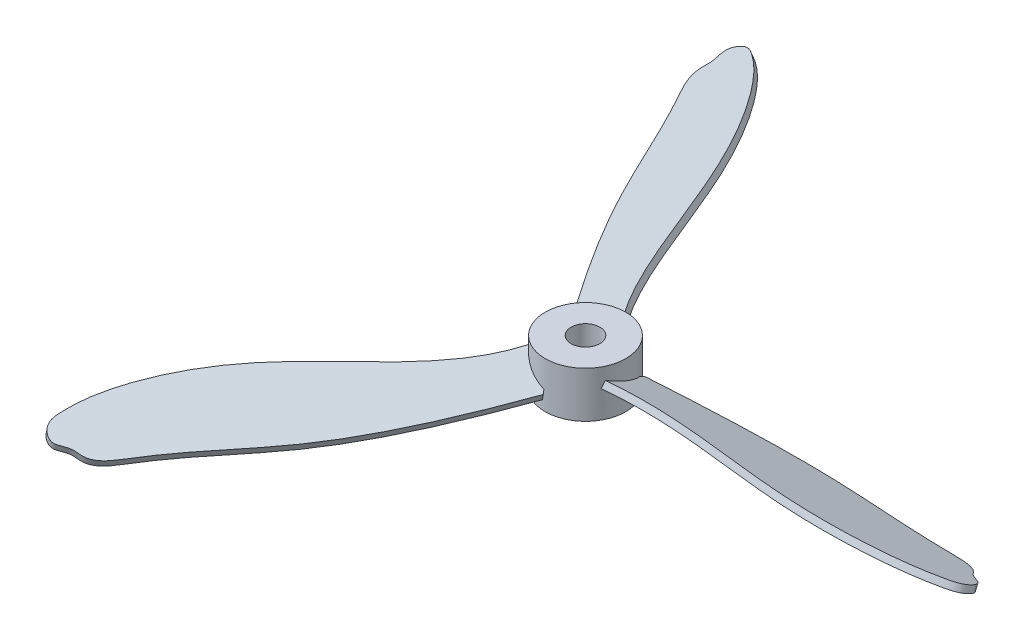
ISO-10303-21;
HEADER;
FILE_DESCRIPTION(('STEP AP214'),'2;1');
FILE_NAME('part.step','',(''),(''),'','','');
FILE_SCHEMA(('AUTOMOTIVE_DESIGN { 1 0 10303 214 1 1 1 1 }'));
ENDSEC;
DATA;
#1=APPLICATION_CONTEXT('core data for automotive mechanical design processes');
#2=APPLICATION_PROTOCOL_DEFINITION('international standard','automotive_design',2000,#1);
#3=PRODUCT_CONTEXT('',#1,'mechanical');
#4=PRODUCT('Part','Part','',(#3));
#5=PRODUCT_RELATED_PRODUCT_CATEGORY('part','',(#4));
#6=PRODUCT_DEFINITION_FORMATION('','',#4);
#7=PRODUCT_DEFINITION_CONTEXT('part definition',#1,'design');
#8=PRODUCT_DEFINITION('design','',#6,#7);
#9=PRODUCT_DEFINITION_SHAPE('','',#8);
#10=(LENGTH_UNIT() NAMED_UNIT(*) SI_UNIT(.MILLI.,.METRE.));
#11=(NAMED_UNIT(*) PLANE_ANGLE_UNIT() SI_UNIT($,.RADIAN.));
#12=(NAMED_UNIT(*) SI_UNIT($,.STERADIAN.) SOLID_ANGLE_UNIT());
#13=UNCERTAINTY_MEASURE_WITH_UNIT(LENGTH_MEASURE(1.E-05),#10,'distance_accuracy_value','');
#14=(GEOMETRIC_REPRESENTATION_CONTEXT(3) GLOBAL_UNCERTAINTY_ASSIGNED_CONTEXT((#13)) GLOBAL_UNIT_ASSIGNED_CONTEXT((#10,
#11,#12)) REPRESENTATION_CONTEXT('',''));
#15=CARTESIAN_POINT('',(0.,0.,0.));
#16=DIRECTION('',(0.,0.,1.));
#17=DIRECTION('',(1.,0.,0.));
#18=AXIS2_PLACEMENT_3D('',#15,#16,#17);
#19=CARTESIAN_POINT('',(0.,-4.,0.));
#20=DIRECTION('',(0.,1.,0.));
#21=DIRECTION('',(0.,0.,1.));
#22=AXIS2_PLACEMENT_3D('',#19,#20,#21);
#23=CYLINDRICAL_SURFACE('',#22,7.);
#24=CARTESIAN_POINT('',(0.,0.649435320175439,0.));
#25=DIRECTION('',(0.331413574035593,0.923879532511287,0.191341716182542));
#26=DIRECTION('',(-0.80010314519127,0.38268343236509,-0.461939766255636));
#27=AXIS2_PLACEMENT_3D('',#24,#25,#26);
#28=ELLIPSE('',#27,7.57674540204676,7.);
#29=CARTESIAN_POINT('',(-0.233981537066314,-0.715568292985856,6.99608838139657));
#30=VERTEX_POINT('',#29);
#31=CARTESIAN_POINT('',(-5.69895796905672,1.85193321203644,4.06471131409415));
#32=VERTEX_POINT('',#31);
#33=EDGE_CURVE('E11',#30,#32,#28,.F.);
#34=ORIENTED_EDGE('',*,*,#33,.F.);
#35=CARTESIAN_POINT('',(0.,36.1517341565032,0.));
#36=DIRECTION('',(0.741474590271592,-0.129634901341056,-0.65833898892278));
#37=DIRECTION('',(0.0969389763581632,0.991561794521297,-0.0860699861062893));
#38=AXIS2_PLACEMENT_3D('',#35,#36,#37);
#39=ELLIPSE('',#38,53.997804044944,7.);
#40=CARTESIAN_POINT('',(-0.456472154964879,-1.93235161450674,6.98510079896788));
#41=VERTEX_POINT('',#40);
#42=EDGE_CURVE('E164',#41,#30,#39,.F.);
#43=ORIENTED_EDGE('',*,*,#42,.F.);
#44=CARTESIAN_POINT('',(0.,-0.649435320175434,0.));
#45=DIRECTION('',(0.331413574035593,0.923879532511287,0.191341716182542));
#46=DIRECTION('',(-0.80010314519127,0.38268343236509,-0.461939766255636));
#47=AXIS2_PLACEMENT_3D('',#44,#45,#46);
#48=ELLIPSE('',#47,7.57674540204676,7.);
#49=CARTESIAN_POINT('',(-6.00799740329603,0.761779417307958,3.59220923694433));
#50=VERTEX_POINT('',#49);
#51=EDGE_CURVE('E116',#41,#50,#48,.F.);
#52=ORIENTED_EDGE('',*,*,#51,.T.);
#53=CARTESIAN_POINT('',(-5.69895796905672,1.85193321203644,4.06471131409414));
#54=CARTESIAN_POINT('',(-5.71670376358482,1.79094450689966,4.03983049687951));
#55=CARTESIAN_POINT('',(-5.73435871566813,1.73001773568598,4.01473277115989));
#56=CARTESIAN_POINT('',(-5.76948000274245,1.60830276861221,3.96409513453521));
#57=CARTESIAN_POINT('',(-5.78694635973355,1.54751455725591,3.93855527613098));
#58=CARTESIAN_POINT('',(-5.82168662404844,1.42608083280721,3.88702075719369));
#59=CARTESIAN_POINT('',(-5.83896054336394,1.36543531101102,3.86102612526214));
#60=CARTESIAN_POINT('',(-5.87331184698468,1.24429112556073,3.80856809179306));
#61=CARTESIAN_POINT('',(-5.89038923035562,1.18379246260586,3.78210468802858));
#62=CARTESIAN_POINT('',(-5.92434277203603,1.06294760964318,3.728694718011));
#63=CARTESIAN_POINT('',(-5.94121891863318,1.00260142866962,3.70174812386173));
#64=CARTESIAN_POINT('',(-5.97476494660159,0.882067361104412,3.64735580338877));
#65=CARTESIAN_POINT('',(-5.99143480215664,0.821879495052533,3.61991001563424));
#66=CARTESIAN_POINT('',(-6.00799740329603,0.761779417307958,3.59220923694433));
#67=B_SPLINE_CURVE_WITH_KNOTS('',3,(#53,#54,#55,#56,#57,#58,#59,#60,#61,#62,#63,#64,#65,#66),
.UNSPECIFIED.,.F.,.F.,(4,2,2,2,2,2,4),(0.,0.204651417883314,0.409278698994972,0.613893156677688,
0.818508586662214,1.02313586804236,1.2277885035829),.UNSPECIFIED.);
#68=EDGE_CURVE('E52',#32,#50,#67,.T.);
#69=ORIENTED_EDGE('',*,*,#68,.F.);
#70=EDGE_LOOP('',(#34,#43,#52,#69));
#71=FACE_BOUND('',#70,.T.);
#72=CARTESIAN_POINT('',(0.,0.649435320175437,0.));
#73=DIRECTION('',(-0.331413574035591,0.923879532511287,0.191341716182546));
#74=DIRECTION('',(0.800103145191263,0.38268343236509,-0.461939766255647));
#75=AXIS2_PLACEMENT_3D('',#72,#73,#74);
#76=ELLIPSE('',#75,7.57674540204676,7.);
#77=CARTESIAN_POINT('',(-5.94179949687741,-0.715568292985855,-3.70067814581427));
#78=VERTEX_POINT('',#77);
#79=CARTESIAN_POINT('',(-0.670664272527165,1.85193321203644,-6.96779803334997));
#80=VERTEX_POINT('',#79);
#81=EDGE_CURVE('E169',#78,#80,#76,.F.);
#82=ORIENTED_EDGE('',*,*,#81,.F.);
#83=CARTESIAN_POINT('',(0.,36.1517341565032,0.));
#84=DIRECTION('',(0.199400993573089,-0.129634901341056,0.971305325897248));
#85=DIRECTION('',(0.026069306292338,0.991561794521297,0.126986609196173));
#86=AXIS2_PLACEMENT_3D('',#83,#84,#85);
#87=ELLIPSE('',#86,53.9978040449441,7.);
#88=CARTESIAN_POINT('',(-5.8210386624187,-1.93235161450674,-3.88786688180378));
#89=VERTEX_POINT('',#88);
#90=EDGE_CURVE('E180',#89,#78,#87,.F.);
#91=ORIENTED_EDGE('',*,*,#90,.F.);
#92=CARTESIAN_POINT('',(0.,-0.649435320175434,0.));
#93=DIRECTION('',(-0.331413574035591,0.923879532511287,0.191341716182546));
#94=DIRECTION('',(0.800103145191263,0.38268343236509,-0.461939766255647));
#95=AXIS2_PLACEMENT_3D('',#92,#93,#94);
#96=ELLIPSE('',#95,7.57674540204676,7.);
#97=CARTESIAN_POINT('',(-0.106945753254865,0.761779417307957,-6.99918299559748));
#98=VERTEX_POINT('',#97);
#99=EDGE_CURVE('E259',#89,#98,#96,.F.);
#100=ORIENTED_EDGE('',*,*,#99,.T.);
#101=CARTESIAN_POINT('',(-0.670664272527156,1.85193321203644,-6.96779803334996));
#102=CARTESIAN_POINT('',(-0.640243955488321,1.79094450689966,-6.97072593361432));
#103=CARTESIAN_POINT('',(-0.60968121139626,1.73001773568598,-6.97346670776126));
#104=CARTESIAN_POINT('',(-0.548267088154522,1.60830276861221,-6.97856381626888));
#105=CARTESIAN_POINT('',(-0.517415743471851,1.54751455725591,-6.98092019593262));
#106=CARTESIAN_POINT('',(-0.455415408742906,1.42608083280721,-6.98523888789486));
#107=CARTESIAN_POINT('',(-0.424266437470407,1.36543531101102,-6.98720122487923));
#108=CARTESIAN_POINT('',(-0.361660796043238,1.24429112556073,-6.99072130973336));
#109=CARTESIAN_POINT('',(-0.330204124427126,1.18379246260586,-6.99227905568053));
#110=CARTESIAN_POINT('',(-0.266972962736327,1.06294760964318,-6.99497870031543));
#111=CARTESIAN_POINT('',(-0.235198454359017,1.00260142866962,-6.99612057491192));
#112=CARTESIAN_POINT('',(-0.171320309074448,0.882067361104412,-6.99797612709213));
#113=CARTESIAN_POINT('',(-0.139216631874623,0.821879495052533,-6.99868975160296));
#114=CARTESIAN_POINT('',(-0.106945753254856,0.761779417307958,-6.99918299559747));
#115=B_SPLINE_CURVE_WITH_KNOTS('',3,(#101,#102,#103,#104,#105,#106,#107,#108,#109,#110,#111,
#112,#113,#114),.UNSPECIFIED.,.F.,.F.,(4,2,2,2,2,2,4),(0.,0.204651417883314,0.409278698994971,
0.613893156677686,0.818508586662211,1.02313586804236,1.2277885035829),.UNSPECIFIED.);
#116=EDGE_CURVE('E172',#80,#98,#115,.T.);
#117=ORIENTED_EDGE('',*,*,#116,.F.);
#118=EDGE_LOOP('',(#82,#91,#100,#117));
#119=FACE_BOUND('',#118,.T.);
#120=CARTESIAN_POINT('',(0.,0.649435320175438,0.));
#121=DIRECTION('',(0.,0.923879532511287,-0.38268343236509));
#122=DIRECTION('',(0.,0.38268343236509,0.923879532511287));
#123=AXIS2_PLACEMENT_3D('',#120,#121,#122);
#124=ELLIPSE('',#123,7.57674540204676,7.);
#125=CARTESIAN_POINT('',(6.17578103394377,-0.715568292985857,-3.29541023558227));
#126=VERTEX_POINT('',#125);
#127=CARTESIAN_POINT('',(6.36962224158388,1.85193321203644,2.90308671925588));
#128=VERTEX_POINT('',#127);
#129=EDGE_CURVE('E255',#126,#128,#124,.F.);
#130=ORIENTED_EDGE('',*,*,#129,.F.);
#131=CARTESIAN_POINT('',(0.,36.1517341565032,0.));
#132=DIRECTION('',(-0.940875583844683,-0.129634901341056,-0.312966336974476));
#133=DIRECTION('',(-0.123008282650501,0.991561794521297,-0.040916623089885));
#134=AXIS2_PLACEMENT_3D('',#131,#132,#133);
#135=ELLIPSE('',#134,53.9978040449441,7.);
#136=CARTESIAN_POINT('',(6.27751081738363,-1.93235161450674,-3.09723391716407));
#137=VERTEX_POINT('',#136);
#138=EDGE_CURVE('E256',#137,#126,#135,.F.);
#139=ORIENTED_EDGE('',*,*,#138,.F.);
#140=CARTESIAN_POINT('',(0.,-0.649435320175435,0.));
#141=DIRECTION('',(0.,0.923879532511287,-0.38268343236509));
#142=DIRECTION('',(0.,0.38268343236509,0.923879532511287));
#143=AXIS2_PLACEMENT_3D('',#140,#141,#142);
#144=ELLIPSE('',#143,7.57674540204676,7.);
#145=CARTESIAN_POINT('',(6.11494315655089,0.761779417307958,3.4069737586532));
#146=VERTEX_POINT('',#145);
#147=EDGE_CURVE('E461',#137,#146,#144,.F.);
#148=ORIENTED_EDGE('',*,*,#147,.T.);
#149=CARTESIAN_POINT('',(6.36962224158388,1.85193321203644,2.90308671925588));
#150=CARTESIAN_POINT('',(6.35694771907315,1.79094450689966,2.93089543673487));
#151=CARTESIAN_POINT('',(6.3440399270644,1.73001773568598,2.95873393660143));
#152=CARTESIAN_POINT('',(6.31774709089698,1.60830276861221,3.01446868173373));
#153=CARTESIAN_POINT('',(6.3043621032054,1.54751455725591,3.04236491980171));
#154=CARTESIAN_POINT('',(6.27710203279135,1.42608083280721,3.09821813070123));
#155=CARTESIAN_POINT('',(6.26322698083435,1.36543531101102,3.12617509961715));
#156=CARTESIAN_POINT('',(6.23497264302792,1.24429112556073,3.18215321794036));
#157=CARTESIAN_POINT('',(6.22059335478275,1.18379246260586,3.210174367652));
#158=CARTESIAN_POINT('',(6.19131573477237,1.06294760964318,3.26628398230449));
#159=CARTESIAN_POINT('',(6.1764173729922,1.00260142866962,3.29437245105024));
#160=CARTESIAN_POINT('',(6.14608525567604,0.882067361104411,3.35062032370342));
#161=CARTESIAN_POINT('',(6.13065143403127,0.821879495052532,3.37877973596878));
#162=CARTESIAN_POINT('',(6.11494315655089,0.761779417307958,3.4069737586532));
#163=B_SPLINE_CURVE_WITH_KNOTS('',3,(#149,#150,#151,#152,#153,#154,#155,#156,#157,#158,#159,
#160,#161,#162),.UNSPECIFIED.,.F.,.F.,(4,2,2,2,2,2,4),(0.,0.204651417883314,0.409278698994971,
0.613893156677687,0.818508586662212,1.02313586804236,1.2277885035829),.UNSPECIFIED.);
#164=EDGE_CURVE('E246',#128,#146,#163,.T.);
#165=ORIENTED_EDGE('',*,*,#164,.F.);
#166=EDGE_LOOP('',(#130,#139,#148,#165));
#167=FACE_BOUND('',#166,.T.);
#168=CARTESIAN_POINT('',(0.,-4.,0.));
#169=DIRECTION('',(0.,1.,0.));
#170=DIRECTION('',(0.,0.,1.));
#171=AXIS2_PLACEMENT_3D('',#168,#169,#170);
#172=CIRCLE('',#171,7.);
#173=CARTESIAN_POINT('',(0.,-4.,7.));
#174=VERTEX_POINT('',#173);
#175=EDGE_CURVE('E458',#174,#174,#172,.T.);
#176=ORIENTED_EDGE('',*,*,#175,.T.);
#177=EDGE_LOOP('',(#176));
#178=FACE_BOUND('',#177,.T.);
#179=CARTESIAN_POINT('',(0.,4.,0.));
#180=DIRECTION('',(0.,1.,0.));
#181=DIRECTION('',(0.,0.,1.));
#182=AXIS2_PLACEMENT_3D('',#179,#180,#181);
#183=CIRCLE('',#182,7.);
#184=CARTESIAN_POINT('',(0.,4.,7.));
#185=VERTEX_POINT('',#184);
#186=EDGE_CURVE('E447',#185,#185,#183,.T.);
#187=ORIENTED_EDGE('',*,*,#186,.F.);
#188=EDGE_LOOP('',(#187));
#189=FACE_BOUND('',#188,.T.);
#190=ADVANCED_FACE('F43',(#71,#119,#167,#178,#189),#23,.T.);
#191=CARTESIAN_POINT('',(0.,-4.,0.));
#192=DIRECTION('',(0.,1.,0.));
#193=DIRECTION('',(0.,0.,1.));
#194=AXIS2_PLACEMENT_3D('',#191,#192,#193);
#195=PLANE('',#194);
#196=CARTESIAN_POINT('',(0.,-4.,0.));
#197=DIRECTION('',(0.,1.,0.));
#198=DIRECTION('',(0.,0.,1.));
#199=AXIS2_PLACEMENT_3D('',#196,#197,#198);
#200=CIRCLE('',#199,2.5);
#201=CARTESIAN_POINT('',(0.,-4.,2.5));
#202=VERTEX_POINT('',#201);
#203=EDGE_CURVE('E441',#202,#202,#200,.T.);
#204=ORIENTED_EDGE('',*,*,#203,.T.);
#205=EDGE_LOOP('',(#204));
#206=FACE_BOUND('',#205,.T.);
#207=ORIENTED_EDGE('',*,*,#175,.F.);
#208=EDGE_LOOP('',(#207));
#209=FACE_BOUND('',#208,.T.);
#210=ADVANCED_FACE('F287',(#206,#209),#195,.F.);
#211=CARTESIAN_POINT('',(0.,-4.,0.));
#212=DIRECTION('',(0.,1.,0.));
#213=DIRECTION('',(0.,0.,1.));
#214=AXIS2_PLACEMENT_3D('',#211,#212,#213);
#215=CYLINDRICAL_SURFACE('',#214,2.5);
#216=ORIENTED_EDGE('',*,*,#203,.F.);
#217=EDGE_LOOP('',(#216));
#218=FACE_BOUND('',#217,.T.);
#219=CARTESIAN_POINT('',(0.,4.,0.));
#220=DIRECTION('',(0.,1.,0.));
#221=DIRECTION('',(0.,0.,1.));
#222=AXIS2_PLACEMENT_3D('',#219,#220,#221);
#223=CIRCLE('',#222,2.5);
#224=CARTESIAN_POINT('',(0.,4.,2.5));
#225=VERTEX_POINT('',#224);
#226=EDGE_CURVE('E444',#225,#225,#223,.T.);
#227=ORIENTED_EDGE('',*,*,#226,.T.);
#228=EDGE_LOOP('',(#227));
#229=FACE_BOUND('',#228,.T.);
#230=ADVANCED_FACE('F292',(#218,#229),#215,.F.);
#231=CARTESIAN_POINT('',(0.,4.,0.));
#232=DIRECTION('',(0.,1.,0.));
#233=DIRECTION('',(0.,0.,1.));
#234=AXIS2_PLACEMENT_3D('',#231,#232,#233);
#235=PLANE('',#234);
#236=ORIENTED_EDGE('',*,*,#186,.T.);
#237=EDGE_LOOP('',(#236));
#238=FACE_BOUND('',#237,.T.);
#239=ORIENTED_EDGE('',*,*,#226,.F.);
#240=EDGE_LOOP('',(#239));
#241=FACE_BOUND('',#240,.T.);
#242=ADVANCED_FACE('F242',(#238,#241),#235,.T.);
#243=CARTESIAN_POINT('',(6.44264124281833,-0.999212161432029,-3.98018710966899));
#244=CARTESIAN_POINT('',(16.850129528559,-1.49763062902295,-5.18347573386421));
#245=CARTESIAN_POINT('',(35.2792890615401,-2.14502035084786,-6.74641278043485));
#246=CARTESIAN_POINT('',(53.2831575555021,-0.926840298546662,-3.80546597675693));
#247=CARTESIAN_POINT('',(64.0154993372251,-1.00249855295517,-3.98812116065543));
#248=CARTESIAN_POINT('',(65.9050921473247,0.152386060638488,-1.1999830635416));
#249=CARTESIAN_POINT('',(68.4240487076236,0.351047966224013,-0.720370796750146));
#250=CARTESIAN_POINT('',(68.2678887950458,1.61612572687894,2.33379709047955));
#251=CARTESIAN_POINT('',(63.9598466062221,2.50655432932753,4.48348189883587));
#252=CARTESIAN_POINT('',(54.6879080196774,3.39428020303318,6.62664174280554));
#253=CARTESIAN_POINT('',(33.351144776362,3.42257530454389,6.69495216062142));
#254=CARTESIAN_POINT('',(15.5737232215834,0.790449230800057,0.340437695513227));
#255=CARTESIAN_POINT('',(3.51941234036832,2.10786760044557,3.52096699083088));
#256=B_SPLINE_CURVE_WITH_KNOTS('',3,(#243,#244,#245,#246,#247,#248,#249,#250,#251,#252,#253,
#254,#255),.UNSPECIFIED.,.F.,.F.,(4,1,1,1,1,1,1,1,1,1,4),(0.,0.246202510835796,
0.401236662355742,0.448756168744394,0.459405019178207,0.479964885775962,0.497385717987624,
0.519084515206538,0.584945870504471,0.719402983656303,1.),.UNSPECIFIED.);
#257=DIRECTION('',(0.,-0.923879532511287,0.38268343236509));
#258=VECTOR('',#257,1.);
#259=SURFACE_OF_LINEAR_EXTRUSION('',#256,#258);
#260=CARTESIAN_POINT('',(6.44264124281833,-0.999212161432029,-3.98018710966899));
#261=VERTEX_POINT('',#260);
#262=EDGE_CURVE('E223',#261,#128,#256,.T.);
#263=ORIENTED_EDGE('',*,*,#262,.T.);
#264=ORIENTED_EDGE('',*,*,#164,.T.);
#265=CARTESIAN_POINT('',(6.44264124281833,-2.10786760044557,-3.52096699083088));
#266=CARTESIAN_POINT('',(16.850129528559,-2.60628606803649,-4.7242556150261));
#267=CARTESIAN_POINT('',(35.2792890615401,-3.2536757898614,-6.28719266159674));
#268=CARTESIAN_POINT('',(53.2831575555021,-2.03549573756021,-3.34624585791882));
#269=CARTESIAN_POINT('',(64.0154993372251,-2.11115399196872,-3.52890104181732));
#270=CARTESIAN_POINT('',(65.9050921473247,-0.956269378375056,-0.740762944703496));
#271=CARTESIAN_POINT('',(68.4240487076236,-0.757607472789531,-0.261150677912039));
#272=CARTESIAN_POINT('',(68.2678887950458,0.507470287865393,2.79301720931766));
#273=CARTESIAN_POINT('',(63.9598466062221,1.39789889031399,4.94270201767398));
#274=CARTESIAN_POINT('',(54.6879080196774,2.28562476401963,7.08586186164365));
#275=CARTESIAN_POINT('',(33.351144776362,2.31391986553034,7.15417227945953));
#276=CARTESIAN_POINT('',(15.5737232215834,-0.318206208213487,0.799657814351335));
#277=CARTESIAN_POINT('',(3.51941234036832,0.999212161432029,3.98018710966899));
#278=B_SPLINE_CURVE_WITH_KNOTS('',3,(#265,#266,#267,#268,#269,#270,#271,#272,#273,#274,#275,
#276,#277),.UNSPECIFIED.,.F.,.F.,(4,1,1,1,1,1,1,1,1,1,4),(0.,0.246202510835796,
0.401236662355742,0.448756168744394,0.459405019178207,0.479964885775962,0.497385717987624,
0.519084515206538,0.584945870504471,0.719402983656303,1.),.UNSPECIFIED.);
#279=CARTESIAN_POINT('',(6.44264124281833,-2.10786760044557,-3.52096699083088));
#280=VERTEX_POINT('',#279);
#281=EDGE_CURVE('E212',#280,#146,#278,.T.);
#282=ORIENTED_EDGE('',*,*,#281,.F.);
#283=DIRECTION('',(0.,-0.923879532511287,0.38268343236509));
#284=VECTOR('',#283,1.);
#285=CARTESIAN_POINT('',(6.44264124281833,-0.999212161432029,-3.98018710966899));
#286=LINE('',#285,#284);
#287=EDGE_CURVE('E448',#261,#280,#286,.T.);
#288=ORIENTED_EDGE('',*,*,#287,.F.);
#289=EDGE_LOOP('',(#263,#264,#282,#288));
#290=FACE_BOUND('',#289,.T.);
#291=ADVANCED_FACE('F236',(#290),#259,.T.);
#292=CARTESIAN_POINT('',(6.44264124281833,-0.999212161432029,-3.98018710966899));
#293=DIRECTION('',(-0.940875583844683,-0.129634901341056,-0.312966336974476));
#294=DIRECTION('',(-0.315629685112634,0.,0.948882448923838));
#295=AXIS2_PLACEMENT_3D('',#292,#293,#294);
#296=PLANE('',#295);
#297=DIRECTION('',(0.338752322095253,-0.360057497854191,-0.86925569455371));
#298=VECTOR('',#297,1.);
#299=CARTESIAN_POINT('',(6.44264124281833,-2.10786760044557,-3.52096699083088));
#300=LINE('',#299,#298);
#301=EDGE_CURVE('E217',#137,#280,#300,.T.);
#302=ORIENTED_EDGE('',*,*,#301,.F.);
#303=ORIENTED_EDGE('',*,*,#138,.T.);
#304=DIRECTION('',(0.338752322095253,-0.360057497854191,-0.86925569455371));
#305=VECTOR('',#304,1.);
#306=CARTESIAN_POINT('',(6.44264124281833,-0.999212161432029,-3.98018710966899));
#307=LINE('',#306,#305);
#308=EDGE_CURVE('E230',#126,#261,#307,.T.);
#309=ORIENTED_EDGE('',*,*,#308,.T.);
#310=ORIENTED_EDGE('',*,*,#287,.T.);
#311=EDGE_LOOP('',(#302,#303,#309,#310));
#312=FACE_BOUND('',#311,.T.);
#313=ADVANCED_FACE('F241',(#312),#296,.T.);
#314=CARTESIAN_POINT('',(67.8069855791169,1.54219271924391,2.15530702074003));
#315=DIRECTION('',(0.,0.923879532511287,-0.38268343236509));
#316=DIRECTION('',(0.,0.38268343236509,0.923879532511287));
#317=AXIS2_PLACEMENT_3D('',#314,#315,#316);
#318=PLANE('',#317);
#319=ORIENTED_EDGE('',*,*,#308,.F.);
#320=ORIENTED_EDGE('',*,*,#129,.T.);
#321=ORIENTED_EDGE('',*,*,#262,.F.);
#322=EDGE_LOOP('',(#319,#320,#321));
#323=FACE_BOUND('',#322,.T.);
#324=ADVANCED_FACE('F353',(#323),#318,.T.);
#325=CARTESIAN_POINT('',(67.8069855791169,0.433537280230364,2.61452713957814));
#326=DIRECTION('',(0.,0.923879532511287,-0.38268343236509));
#327=DIRECTION('',(0.,0.38268343236509,0.923879532511287));
#328=AXIS2_PLACEMENT_3D('',#325,#326,#327);
#329=PLANE('',#328);
#330=ORIENTED_EDGE('',*,*,#147,.F.);
#331=ORIENTED_EDGE('',*,*,#301,.T.);
#332=ORIENTED_EDGE('',*,*,#281,.T.);
#333=EDGE_LOOP('',(#330,#331,#332));
#334=FACE_BOUND('',#333,.T.);
#335=ADVANCED_FACE('F189',(#334),#329,.F.);
#336=CARTESIAN_POINT('',(-6.66826377019789,-0.999212161432029,-3.5893974289155));
#337=CARTESIAN_POINT('',(-12.9140864297062,-1.49763062902295,-12.0009023618583));
#338=CARTESIAN_POINT('',(-23.4822093830427,-2.14502035084786,-27.1795541645306));
#339=CARTESIAN_POINT('',(-29.9372089868601,-0.926840298546662,-44.241835048535));
#340=CARTESIAN_POINT('',(-35.4615639071107,-1.00249855295517,-53.444988081655));
#341=CARTESIAN_POINT('',(-33.9917618908007,0.152386060638489,-56.4754925065665));
#342=CARTESIAN_POINT('',(-34.8358837639421,0.351047966224013,-58.8967790122106));
#343=CARTESIAN_POINT('',(-32.1128168298897,1.61612572687894,-60.2886245044803));
#344=CARTESIAN_POINT('',(-28.0971140813118,2.50655432932753,-57.6325929325621));
#345=CARTESIAN_POINT('',(-21.6051139187909,3.39428020303318,-50.67443849627));
#346=CARTESIAN_POINT('',(-10.8775737399615,3.42257530454389,-32.2304147019328));
#347=CARTESIAN_POINT('',(-7.49203391807148,0.790449230800057,-13.6574587891554));
#348=CARTESIAN_POINT('',(1.28954068976181,2.10786760044557,-4.80838398856685));
#349=B_SPLINE_CURVE_WITH_KNOTS('',3,(#336,#337,#338,#339,#340,#341,#342,#343,#344,#345,#346,
#347,#348),.UNSPECIFIED.,.F.,.F.,(4,1,1,1,1,1,1,1,1,1,4),(0.,0.246202510835796,
0.401236662355742,0.448756168744394,0.459405019178207,0.479964885775962,0.497385717987624,
0.519084515206538,0.584945870504471,0.719402983656303,1.),.UNSPECIFIED.);
#350=DIRECTION('',(0.331413574035591,-0.923879532511287,-0.191341716182546));
#351=VECTOR('',#350,1.);
#352=SURFACE_OF_LINEAR_EXTRUSION('',#349,#351);
#353=CARTESIAN_POINT('',(-6.66826377019789,-0.999212161432029,-3.5893974289155));
#354=VERTEX_POINT('',#353);
#355=EDGE_CURVE('E192',#354,#80,#349,.T.);
#356=ORIENTED_EDGE('',*,*,#355,.T.);
#357=ORIENTED_EDGE('',*,*,#116,.T.);
#358=CARTESIAN_POINT('',(-6.27056748135518,-2.10786760044557,-3.81900748833456));
#359=CARTESIAN_POINT('',(-12.5163901408635,-2.60628606803649,-12.2305124212773));
#360=CARTESIAN_POINT('',(-23.0845130942,-3.2536757898614,-27.4091642239497));
#361=CARTESIAN_POINT('',(-29.5395126980174,-2.03549573756021,-44.471445107954));
#362=CARTESIAN_POINT('',(-35.063867618268,-2.11115399196872,-53.674598141074));
#363=CARTESIAN_POINT('',(-33.594065601958,-0.956269378375056,-56.7051025659856));
#364=CARTESIAN_POINT('',(-34.4381874750994,-0.757607472789531,-59.1263890716296));
#365=CARTESIAN_POINT('',(-31.715120541047,0.507470287865392,-60.5182345638994));
#366=CARTESIAN_POINT('',(-27.699417792469,1.39789889031399,-57.8622029919811));
#367=CARTESIAN_POINT('',(-21.2074176299482,2.28562476401963,-50.9040485556891));
#368=CARTESIAN_POINT('',(-10.4798774511188,2.31391986553034,-32.4600247613519));
#369=CARTESIAN_POINT('',(-7.09433762922877,-0.318206208213487,-13.8870688485745));
#370=CARTESIAN_POINT('',(1.68723697860452,0.999212161432029,-5.03799404798591));
#371=B_SPLINE_CURVE_WITH_KNOTS('',3,(#358,#359,#360,#361,#362,#363,#364,#365,#366,#367,#368,
#369,#370),.UNSPECIFIED.,.F.,.F.,(4,1,1,1,1,1,1,1,1,1,4),(0.,0.246202510835796,
0.401236662355742,0.448756168744394,0.459405019178207,0.479964885775962,0.497385717987624,
0.519084515206538,0.584945870504471,0.719402983656303,1.),.UNSPECIFIED.);
#372=CARTESIAN_POINT('',(-6.27056748135518,-2.10786760044557,-3.81900748833456));
#373=VERTEX_POINT('',#372);
#374=EDGE_CURVE('E67',#373,#98,#371,.T.);
#375=ORIENTED_EDGE('',*,*,#374,.F.);
#376=DIRECTION('',(0.331413574035591,-0.923879532511287,-0.191341716182546));
#377=VECTOR('',#376,1.);
#378=CARTESIAN_POINT('',(-6.66826377019789,-0.999212161432029,-3.5893974289155));
#379=LINE('',#378,#377);
#380=EDGE_CURVE('E208',#354,#373,#379,.T.);
#381=ORIENTED_EDGE('',*,*,#380,.F.);
#382=EDGE_LOOP('',(#356,#357,#375,#381));
#383=FACE_BOUND('',#382,.T.);
#384=ADVANCED_FACE('F182',(#383),#352,.T.);
#385=CARTESIAN_POINT('',(-6.66826377019789,-0.999212161432029,-3.5893974289155));
#386=DIRECTION('',(0.199400993573089,-0.129634901341056,0.971305325897248));
#387=DIRECTION('',(0.97957114852955,0.,-0.201097898965899));
#388=AXIS2_PLACEMENT_3D('',#385,#386,#387);
#389=PLANE('',#388);
#390=DIRECTION('',(-0.922173674915425,-0.360057497854191,0.141259730751401));
#391=VECTOR('',#390,1.);
#392=CARTESIAN_POINT('',(-6.27056748135518,-2.10786760044557,-3.81900748833456));
#393=LINE('',#392,#391);
#394=EDGE_CURVE('E201',#89,#373,#393,.T.);
#395=ORIENTED_EDGE('',*,*,#394,.F.);
#396=ORIENTED_EDGE('',*,*,#90,.T.);
#397=DIRECTION('',(-0.922173674915425,-0.360057497854191,0.141259730751401));
#398=VECTOR('',#397,1.);
#399=CARTESIAN_POINT('',(-6.66826377019789,-0.999212161432029,-3.5893974289155));
#400=LINE('',#399,#398);
#401=EDGE_CURVE('E200',#78,#354,#400,.T.);
#402=ORIENTED_EDGE('',*,*,#401,.T.);
#403=ORIENTED_EDGE('',*,*,#380,.T.);
#404=EDGE_LOOP('',(#395,#396,#402,#403));
#405=FACE_BOUND('',#404,.T.);
#406=ADVANCED_FACE('F188',(#405),#389,.T.);
#407=CARTESIAN_POINT('',(-32.0369421566429,1.54219271924391,-59.8002255759302));
#408=DIRECTION('',(-0.331413574035591,0.923879532511287,0.191341716182546));
#409=DIRECTION('',(0.800103145191264,0.38268343236509,-0.461939766255647));
#410=AXIS2_PLACEMENT_3D('',#407,#408,#409);
#411=PLANE('',#410);
#412=ORIENTED_EDGE('',*,*,#401,.F.);
#413=ORIENTED_EDGE('',*,*,#81,.T.);
#414=ORIENTED_EDGE('',*,*,#355,.F.);
#415=EDGE_LOOP('',(#412,#413,#414));
#416=FACE_BOUND('',#415,.T.);
#417=ADVANCED_FACE('F273',(#416),#411,.T.);
#418=CARTESIAN_POINT('',(-31.6392458678002,0.433537280230364,-60.0298356353493));
#419=DIRECTION('',(-0.331413574035591,0.923879532511287,0.191341716182546));
#420=DIRECTION('',(0.800103145191264,0.38268343236509,-0.461939766255647));
#421=AXIS2_PLACEMENT_3D('',#418,#419,#420);
#422=PLANE('',#421);
#423=ORIENTED_EDGE('',*,*,#99,.F.);
#424=ORIENTED_EDGE('',*,*,#394,.T.);
#425=ORIENTED_EDGE('',*,*,#374,.T.);
#426=EDGE_LOOP('',(#423,#424,#425));
#427=FACE_BOUND('',#426,.T.);
#428=ADVANCED_FACE('F155',(#427),#422,.F.);
#429=CARTESIAN_POINT('',(0.225622527379608,-0.999212161432029,7.56958453858452));
#430=CARTESIAN_POINT('',(-3.93604309885277,-1.49763062902295,17.1843780957226));
#431=CARTESIAN_POINT('',(-11.7970796784971,-2.14502035084786,33.9259669449657));
#432=CARTESIAN_POINT('',(-23.3459485686417,-0.926840298546662,48.0473010252922));
#433=CARTESIAN_POINT('',(-28.5539354301141,-1.00249855295517,57.4331092423108));
#434=CARTESIAN_POINT('',(-31.9133302565237,0.152386060638488,57.6754755701086));
#435=CARTESIAN_POINT('',(-33.5881649436812,0.351047966224013,59.6171498089612));
#436=CARTESIAN_POINT('',(-36.1550719651558,1.61612572687894,57.9548274140012));
#437=CARTESIAN_POINT('',(-35.8627325249101,2.50655432932753,53.1491110337266));
#438=CARTESIAN_POINT('',(-33.0827941008862,3.39428020303318,44.0477967534649));
#439=CARTESIAN_POINT('',(-22.4735710364004,3.42257530454389,25.5354625413117));
#440=CARTESIAN_POINT('',(-8.08168930351186,0.790449230800057,13.3170210936423));
#441=CARTESIAN_POINT('',(-4.80895303013014,2.10786760044557,1.28741699773601));
#442=B_SPLINE_CURVE_WITH_KNOTS('',3,(#429,#430,#431,#432,#433,#434,#435,#436,#437,#438,#439,
#440,#441),.UNSPECIFIED.,.F.,.F.,(4,1,1,1,1,1,1,1,1,1,4),(0.,0.246202510835796,
0.401236662355742,0.448756168744394,0.459405019178207,0.479964885775962,0.497385717987624,
0.519084515206538,0.584945870504471,0.719402983656303,1.),.UNSPECIFIED.);
#443=DIRECTION('',(-0.331413574035594,-0.923879532511287,-0.191341716182542));
#444=VECTOR('',#443,1.);
#445=SURFACE_OF_LINEAR_EXTRUSION('',#442,#444);
#446=CARTESIAN_POINT('',(0.225622527379608,-0.999212161432029,7.56958453858452));
#447=VERTEX_POINT('',#446);
#448=EDGE_CURVE('E120',#447,#32,#442,.T.);
#449=ORIENTED_EDGE('',*,*,#448,.T.);
#450=ORIENTED_EDGE('',*,*,#68,.T.);
#451=CARTESIAN_POINT('',(-0.172073761463104,-2.10786760044557,7.33997447916547));
#452=CARTESIAN_POINT('',(-4.33373938769548,-2.60628606803649,16.9547680363035));
#453=CARTESIAN_POINT('',(-12.1947759673398,-3.2536757898614,33.6963568855466));
#454=CARTESIAN_POINT('',(-23.7436448574844,-2.03549573756021,47.8176909658732));
#455=CARTESIAN_POINT('',(-28.9516317189568,-2.11115399196872,57.2034991828917));
#456=CARTESIAN_POINT('',(-32.3110265453664,-0.956269378375056,57.4458655106895));
#457=CARTESIAN_POINT('',(-33.9858612325239,-0.757607472789531,59.3875397495421));
#458=CARTESIAN_POINT('',(-36.5527682539986,0.507470287865393,57.7252173545822));
#459=CARTESIAN_POINT('',(-36.2604288137528,1.39789889031399,52.9195009743076));
#460=CARTESIAN_POINT('',(-33.480490389729,2.28562476401963,43.8181866940458));
#461=CARTESIAN_POINT('',(-22.8712673252431,2.31391986553034,25.3058524818926));
#462=CARTESIAN_POINT('',(-8.47938559235457,-0.318206208213487,13.0874110342233));
#463=CARTESIAN_POINT('',(-5.20664931897285,0.999212161432029,1.05780693831696));
#464=B_SPLINE_CURVE_WITH_KNOTS('',3,(#451,#452,#453,#454,#455,#456,#457,#458,#459,#460,#461,
#462,#463),.UNSPECIFIED.,.F.,.F.,(4,1,1,1,1,1,1,1,1,1,4),(0.,0.246202510835796,
0.401236662355742,0.448756168744394,0.459405019178207,0.479964885775962,0.497385717987624,
0.519084515206538,0.584945870504471,0.719402983656303,1.),.UNSPECIFIED.);
#465=CARTESIAN_POINT('',(-0.172073761463104,-2.10786760044557,7.33997447916547));
#466=VERTEX_POINT('',#465);
#467=EDGE_CURVE('E59',#466,#50,#464,.T.);
#468=ORIENTED_EDGE('',*,*,#467,.F.);
#469=DIRECTION('',(-0.331413574035594,-0.923879532511287,-0.191341716182542));
#470=VECTOR('',#469,1.);
#471=CARTESIAN_POINT('',(0.225622527379608,-0.999212161432029,7.56958453858452));
#472=LINE('',#471,#470);
#473=EDGE_CURVE('E123',#447,#466,#472,.T.);
#474=ORIENTED_EDGE('',*,*,#473,.F.);
#475=EDGE_LOOP('',(#449,#450,#468,#474));
#476=FACE_BOUND('',#475,.T.);
#477=ADVANCED_FACE('F132',(#476),#445,.T.);
#478=CARTESIAN_POINT('',(0.225622527379608,-0.999212161432029,7.56958453858452));
#479=DIRECTION('',(0.741474590271592,-0.129634901341056,-0.65833898892278));
#480=DIRECTION('',(-0.663941463416923,0.,-0.747784549957937));
#481=AXIS2_PLACEMENT_3D('',#478,#479,#480);
#482=PLANE('',#481);
#483=DIRECTION('',(0.583421352820179,-0.360057497854191,0.727995963802308));
#484=VECTOR('',#483,1.);
#485=CARTESIAN_POINT('',(-0.172073761463104,-2.10786760044557,7.33997447916547));
#486=LINE('',#485,#484);
#487=EDGE_CURVE('E112',#41,#466,#486,.T.);
#488=ORIENTED_EDGE('',*,*,#487,.F.);
#489=ORIENTED_EDGE('',*,*,#42,.T.);
#490=DIRECTION('',(0.583421352820179,-0.360057497854191,0.727995963802308));
#491=VECTOR('',#490,1.);
#492=CARTESIAN_POINT('',(0.225622527379608,-0.999212161432029,7.56958453858452));
#493=LINE('',#492,#491);
#494=EDGE_CURVE('E126',#30,#447,#493,.T.);
#495=ORIENTED_EDGE('',*,*,#494,.T.);
#496=ORIENTED_EDGE('',*,*,#473,.T.);
#497=EDGE_LOOP('',(#488,#489,#495,#496));
#498=FACE_BOUND('',#497,.T.);
#499=ADVANCED_FACE('F124',(#498),#482,.T.);
#500=CARTESIAN_POINT('',(-35.7700434224738,1.54219271924391,57.6449185551907));
#501=DIRECTION('',(0.331413574035593,0.923879532511287,0.191341716182542));
#502=DIRECTION('',(-0.80010314519127,0.38268343236509,-0.461939766255636));
#503=AXIS2_PLACEMENT_3D('',#500,#501,#502);
#504=PLANE('',#503);
#505=ORIENTED_EDGE('',*,*,#494,.F.);
#506=ORIENTED_EDGE('',*,*,#33,.T.);
#507=ORIENTED_EDGE('',*,*,#448,.F.);
#508=EDGE_LOOP('',(#505,#506,#507));
#509=FACE_BOUND('',#508,.T.);
#510=ADVANCED_FACE('F296',(#509),#504,.T.);
#511=CARTESIAN_POINT('',(-36.1677397113165,0.433537280230364,57.4153084957716));
#512=DIRECTION('',(0.331413574035593,0.923879532511287,0.191341716182542));
#513=DIRECTION('',(-0.80010314519127,0.38268343236509,-0.461939766255636));
#514=AXIS2_PLACEMENT_3D('',#511,#512,#513);
#515=PLANE('',#514);
#516=ORIENTED_EDGE('',*,*,#51,.F.);
#517=ORIENTED_EDGE('',*,*,#487,.T.);
#518=ORIENTED_EDGE('',*,*,#467,.T.);
#519=EDGE_LOOP('',(#516,#517,#518));
#520=FACE_BOUND('',#519,.T.);
#521=ADVANCED_FACE('F114',(#520),#515,.F.);
#522=CLOSED_SHELL('',(#190,#210,#230,#242,#291,#313,#324,#335,#384,#406,#417,#428,#477,#499,
#510,#521));
#523=MANIFOLD_SOLID_BREP('B2',#522);
#524=ADVANCED_BREP_SHAPE_REPRESENTATION('',(#18,#523),#14);
#525=SHAPE_DEFINITION_REPRESENTATION(#9,#524);
ENDSEC;
END-ISO-10303-21;
